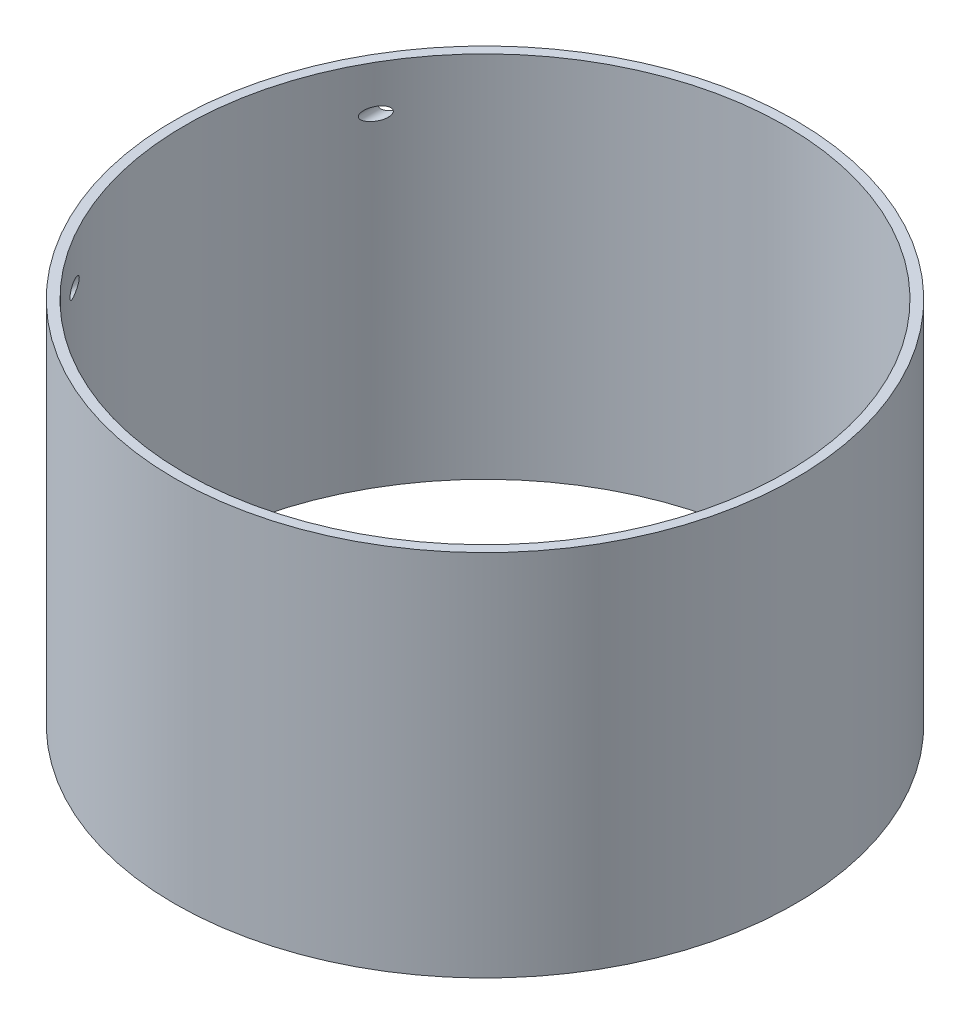
ISO-10303-21;
HEADER;
FILE_DESCRIPTION(('STEP AP214'),'2;1');
FILE_NAME('part.step','',(''),(''),'','','');
FILE_SCHEMA(('AUTOMOTIVE_DESIGN { 1 0 10303 214 1 1 1 1 }'));
ENDSEC;
DATA;
#1=APPLICATION_CONTEXT('core data for automotive mechanical design processes');
#2=APPLICATION_PROTOCOL_DEFINITION('international standard','automotive_design',2000,#1);
#3=PRODUCT_CONTEXT('',#1,'mechanical');
#4=PRODUCT('Part','Part','',(#3));
#5=PRODUCT_RELATED_PRODUCT_CATEGORY('part','',(#4));
#6=PRODUCT_DEFINITION_FORMATION('','',#4);
#7=PRODUCT_DEFINITION_CONTEXT('part definition',#1,'design');
#8=PRODUCT_DEFINITION('design','',#6,#7);
#9=PRODUCT_DEFINITION_SHAPE('','',#8);
#10=(LENGTH_UNIT() NAMED_UNIT(*) SI_UNIT(.MILLI.,.METRE.));
#11=(NAMED_UNIT(*) PLANE_ANGLE_UNIT() SI_UNIT($,.RADIAN.));
#12=(NAMED_UNIT(*) SI_UNIT($,.STERADIAN.) SOLID_ANGLE_UNIT());
#13=UNCERTAINTY_MEASURE_WITH_UNIT(LENGTH_MEASURE(1.E-05),#10,'distance_accuracy_value','');
#14=(GEOMETRIC_REPRESENTATION_CONTEXT(3) GLOBAL_UNCERTAINTY_ASSIGNED_CONTEXT((#13)) GLOBAL_UNIT_ASSIGNED_CONTEXT((#10,
#11,#12)) REPRESENTATION_CONTEXT('',''));
#15=CARTESIAN_POINT('',(0.,0.,0.));
#16=DIRECTION('',(0.,0.,1.));
#17=DIRECTION('',(1.,0.,0.));
#18=AXIS2_PLACEMENT_3D('',#15,#16,#17);
#19=CARTESIAN_POINT('',(0.,25.4,0.));
#20=DIRECTION('',(0.,-1.,0.));
#21=DIRECTION('',(0.,0.,-1.));
#22=AXIS2_PLACEMENT_3D('',#19,#20,#21);
#23=CYLINDRICAL_SURFACE('',#22,101.6);
#24=CARTESIAN_POINT('',(0.,171.45,0.));
#25=DIRECTION('',(0.,1.,0.));
#26=DIRECTION('',(0.,0.,1.));
#27=AXIS2_PLACEMENT_3D('',#24,#25,#26);
#28=CIRCLE('',#27,101.6);
#29=CARTESIAN_POINT('',(0.,171.45,101.6));
#30=VERTEX_POINT('',#29);
#31=EDGE_CURVE('E10',#30,#30,#28,.T.);
#32=ORIENTED_EDGE('',*,*,#31,.F.);
#33=EDGE_LOOP('',(#32));
#34=FACE_BOUND('',#33,.T.);
#35=CARTESIAN_POINT('',(-82.975,156.8,58.631982526604));
#36=CARTESIAN_POINT('',(-82.9750069701916,156.716223390494,58.6319728571658));
#37=CARTESIAN_POINT('',(-82.9800750238246,156.632396471715,58.6248024461642));
#38=CARTESIAN_POINT('',(-82.9997275133866,156.468150598897,58.5969751791364));
#39=CARTESIAN_POINT('',(-83.0143270944433,156.387737285847,58.5762968596785));
#40=CARTESIAN_POINT('',(-83.0512783757542,156.233630110046,58.5238939186319));
#41=CARTESIAN_POINT('',(-83.0735453472675,156.159873487805,58.4922900160161));
#42=CARTESIAN_POINT('',(-83.1241518551298,156.01910483395,58.4203502101725));
#43=CARTESIAN_POINT('',(-83.1524940371646,155.952095759564,58.3800105025212));
#44=CARTESIAN_POINT('',(-83.2311981713577,155.788723660721,58.2677834706447));
#45=CARTESIAN_POINT('',(-83.2849120134787,155.697358965109,58.1910077530873));
#46=CARTESIAN_POINT('',(-83.3994556157458,155.530006955534,58.0267257835989));
#47=CARTESIAN_POINT('',(-83.4603052943858,155.454064382983,57.9391894607723));
#48=CARTESIAN_POINT('',(-83.5759508761657,155.32727470318,57.7722164273101));
#49=CARTESIAN_POINT('',(-83.6300700592509,155.274354471599,57.6938545516566));
#50=CARTESIAN_POINT('',(-83.7404793934565,155.176891066365,57.5334823780236));
#51=CARTESIAN_POINT('',(-83.7967709534556,155.13235344307,57.4514697068713));
#52=CARTESIAN_POINT('',(-83.910866430612,155.050796420756,57.2846987975348));
#53=CARTESIAN_POINT('',(-83.9686717711631,155.013784407132,57.1999379560392));
#54=CARTESIAN_POINT('',(-84.0852767272949,154.946632086246,57.0283877521095));
#55=CARTESIAN_POINT('',(-84.1440766582604,154.916494004315,56.9415977427599));
#56=CARTESIAN_POINT('',(-84.2986884480437,154.845933874674,56.7126105962392));
#57=CARTESIAN_POINT('',(-84.3950122094935,154.810594377097,56.5691799726809));
#58=CARTESIAN_POINT('',(-84.5882537250347,154.754714604347,56.2798157435609));
#59=CARTESIAN_POINT('',(-84.6851718104028,154.734183519156,56.1338806411474));
#60=CARTESIAN_POINT('',(-84.8791569789651,154.706851545887,55.8401270683802));
#61=CARTESIAN_POINT('',(-84.9762234486118,154.700097571483,55.6923038819924));
#62=CARTESIAN_POINT('',(-85.1695501464402,154.699904554876,55.3962001485267));
#63=CARTESIAN_POINT('',(-85.2658106036327,154.706461592166,55.247919748956));
#64=CARTESIAN_POINT('',(-85.4607608061324,154.733300457414,54.9458997733851));
#65=CARTESIAN_POINT('',(-85.5593988878925,154.754107562376,54.7921728163306));
#66=CARTESIAN_POINT('',(-85.7546953545226,154.810438980546,54.486009424797));
#67=CARTESIAN_POINT('',(-85.8513524297379,154.845972719913,54.3335738808055));
#68=CARTESIAN_POINT('',(-86.0412828277664,154.932610975796,54.032296881879));
#69=CARTESIAN_POINT('',(-86.1345732871998,154.983618516699,53.8834391026149));
#70=CARTESIAN_POINT('',(-86.2714494818917,155.073307657953,53.6638096474869));
#71=CARTESIAN_POINT('',(-86.3165408167809,155.105378922504,53.5912485732326));
#72=CARTESIAN_POINT('',(-86.4055126506615,155.174298659439,53.4476800742216));
#73=CARTESIAN_POINT('',(-86.449393433357,155.211146000769,53.3766722862596));
#74=CARTESIAN_POINT('',(-86.544272154067,155.297947401047,53.2227270166106));
#75=CARTESIAN_POINT('',(-86.5949470552264,155.349050259297,53.1402300746396));
#76=CARTESIAN_POINT('',(-86.6935134515872,155.459880832134,52.9792754611917));
#77=CARTESIAN_POINT('',(-86.7414027561459,155.519615209447,52.9008209741642));
#78=CARTESIAN_POINT('',(-86.8336105118755,155.649482768974,52.7493317438014));
#79=CARTESIAN_POINT('',(-86.8778993039352,155.719690989379,52.6763423445038));
#80=CARTESIAN_POINT('',(-86.9606586191414,155.871692442834,52.5396059683285));
#81=CARTESIAN_POINT('',(-86.9991400536509,155.953463376222,52.4758416681037));
#82=CARTESIAN_POINT('',(-87.0556954014423,156.099502210155,52.3819417202016));
#83=CARTESIAN_POINT('',(-87.0762467675868,156.160185549132,52.34776485053));
#84=CARTESIAN_POINT('',(-87.1124121823352,156.286890384476,52.2875594584609));
#85=CARTESIAN_POINT('',(-87.128030129023,156.352907614271,52.261524502988));
#86=CARTESIAN_POINT('',(-87.1531945714062,156.490136111655,52.2195489855936));
#87=CARTESIAN_POINT('',(-87.1626696902436,156.561398087749,52.2037271037683));
#88=CARTESIAN_POINT('',(-87.1741525668396,156.706157258498,52.1845500445412));
#89=CARTESIAN_POINT('',(-87.1761695292592,156.779651584964,52.1811795000304));
#90=CARTESIAN_POINT('',(-87.1727566767227,156.915816387274,52.186880437848));
#91=CARTESIAN_POINT('',(-87.1683097848114,156.978589543844,52.1943096703873));
#92=CARTESIAN_POINT('',(-87.1541240662814,157.101822535777,52.2179935139109));
#93=CARTESIAN_POINT('',(-87.1443816994371,157.162280794565,52.234254028936));
#94=CARTESIAN_POINT('',(-87.116728466356,157.297429977238,52.2803646967071));
#95=CARTESIAN_POINT('',(-87.0972380268677,157.370893092849,52.3128379239913));
#96=CARTESIAN_POINT('',(-87.052418265421,157.510804862722,52.3873875452668));
#97=CARTESIAN_POINT('',(-87.0270768248515,157.577238535252,52.4294838688242));
#98=CARTESIAN_POINT('',(-86.9563999999845,157.739157703799,52.5466594320071));
#99=CARTESIAN_POINT('',(-86.9079172272073,157.829536117953,52.6268353106141));
#100=CARTESIAN_POINT('',(-86.8043310768561,157.995410424153,52.7975204595688));
#101=CARTESIAN_POINT('',(-86.749211386083,158.070868389446,52.888055163058));
#102=CARTESIAN_POINT('',(-86.6401474555037,158.202450701013,53.0665122211123));
#103=CARTESIAN_POINT('',(-86.5866072960789,158.259740166522,53.1538369525626));
#104=CARTESIAN_POINT('',(-86.4768729247724,158.36542644338,53.3321800350003));
#105=CARTESIAN_POINT('',(-86.4206766708538,158.413816268056,53.4232012200406));
#106=CARTESIAN_POINT('',(-86.3061977975174,158.502766005634,53.6079476873526));
#107=CARTESIAN_POINT('',(-86.2479116885063,158.543312023308,53.7016774363655));
#108=CARTESIAN_POINT('',(-86.1297626346507,158.617231068601,53.8909681996178));
#109=CARTESIAN_POINT('',(-86.0698992053928,158.650601863111,53.9865297739178));
#110=CARTESIAN_POINT('',(-85.9122572224367,158.728934072453,54.2372318218994));
#111=CARTESIAN_POINT('',(-85.8134805515754,158.768669076428,54.3933924826184));
#112=CARTESIAN_POINT('',(-85.6135883368883,158.83246764312,54.707478514715));
#113=CARTESIAN_POINT('',(-85.5124713362986,158.856521157393,54.8654049517874));
#114=CARTESIAN_POINT('',(-85.3085877559717,158.889522703432,55.1818838408196));
#115=CARTESIAN_POINT('',(-85.2058203262715,158.898462682406,55.340436581421));
#116=CARTESIAN_POINT('',(-84.999377496824,158.901174587753,55.6569986773372));
#117=CARTESIAN_POINT('',(-84.8957025506711,158.894953703694,55.8150082546433));
#118=CARTESIAN_POINT('',(-84.7144567638553,158.870293205551,56.0895766562435));
#119=CARTESIAN_POINT('',(-84.6369322570584,158.855351585529,56.2064872385635));
#120=CARTESIAN_POINT('',(-84.4821329719449,158.816155935917,56.4388933860953));
#121=CARTESIAN_POINT('',(-84.4048581425014,158.791903953138,56.554389256566));
#122=CARTESIAN_POINT('',(-84.2512165785137,158.733422440074,56.7830205419867));
#123=CARTESIAN_POINT('',(-84.1748480154939,158.699218812556,56.8961612779969));
#124=CARTESIAN_POINT('',(-84.0235118588865,158.619799985895,57.1194154454886));
#125=CARTESIAN_POINT('',(-83.9485434234199,158.574591649365,57.2295307162291));
#126=CARTESIAN_POINT('',(-83.7952333091637,158.467811483455,57.4537961694828));
#127=CARTESIAN_POINT('',(-83.7170740815879,158.405250358279,57.5676077997014));
#128=CARTESIAN_POINT('',(-83.5652547496683,158.263375077176,57.7877668512477));
#129=CARTESIAN_POINT('',(-83.4915926282192,158.184068504387,57.8941176222642));
#130=CARTESIAN_POINT('',(-83.3685309360524,158.026953829382,58.0711356910896));
#131=CARTESIAN_POINT('',(-83.3175187397214,157.953245401777,58.1442862571522));
#132=CARTESIAN_POINT('',(-83.2223151824853,157.793077266952,58.280469346357));
#133=CARTESIAN_POINT('',(-83.1781106486886,157.706642835443,58.3435214198818));
#134=CARTESIAN_POINT('',(-83.1115899126134,157.548349566766,58.4382231871894));
#135=CARTESIAN_POINT('',(-83.0866793640302,157.479846324202,58.4736275818791));
#136=CARTESIAN_POINT('',(-83.0434052005463,157.336821243763,58.5350686872734));
#137=CARTESIAN_POINT('',(-83.025031363016,157.262309029086,58.5611200256229));
#138=CARTESIAN_POINT('',(-82.9990790505797,157.123347233096,58.5978949116336));
#139=CARTESIAN_POINT('',(-82.9901113524311,157.059682364748,58.6105922789686));
#140=CARTESIAN_POINT('',(-82.9780695818706,156.930688358457,58.6276391874058));
#141=CARTESIAN_POINT('',(-82.9749945621079,156.865359489743,58.6319900703511));
#142=CARTESIAN_POINT('',(-82.975,156.8,58.631982526604));
#143=B_SPLINE_CURVE_WITH_KNOTS('',3,(#35,#36,#37,#38,#39,#40,#41,#42,#43,#44,#45,#46,#47,#48,
#49,#50,#51,#52,#53,#54,#55,#56,#57,#58,#59,#60,#61,#62,#63,#64,#65,#66,#67,#68,#69,#70,#71,#72,
#73,#74,#75,#76,#77,#78,#79,#80,#81,#82,#83,#84,#85,#86,#87,#88,#89,#90,#91,#92,#93,#94,#95,#96,
#97,#98,#99,#100,#101,#102,#103,#104,#105,#106,#107,#108,#109,#110,#111,#112,#113,#114,#115,
#116,#117,#118,#119,#120,#121,#122,#123,#124,#125,#126,#127,#128,#129,#130,#131,#132,#133,#134,
#135,#136,#137,#138,#139,#140,#141,#142),.UNSPECIFIED.,.T.,.F.,(4,2,2,2,2,2,2,2,2,2,2,2,2,2,2,2,
2,2,2,2,2,2,2,2,2,2,2,2,2,2,2,2,2,2,2,2,2,2,2,2,2,2,2,2,2,2,2,2,2,2,2,2,2,4),(0.,
0.250991959709652,0.50238370712089,0.751082147678964,0.99988911444596,1.39029801557907,
1.78182384890907,2.1082217415471,2.43483499680136,2.76176724909356,3.08880519099053,
3.6170717085381,4.1456657826091,4.67605683509155,5.20629169357284,5.75720504630901,
6.30847157121046,6.85635223709113,7.12998938939738,7.40356185789304,7.7316182583052,
8.0599292539234,8.39071665453365,8.72087459100963,8.93806403325407,9.1550814340244,
9.37457731028025,9.59380219989295,9.78297512488557,9.97227467497016,10.2188448011969,
10.4659302796672,10.8542891087828,11.2436227750404,11.5952124372338,11.9470769480184,
12.2995591873266,12.6521509696261,13.2183567811676,13.784925052535,14.3517951076846,
14.9183963946328,15.3413355809535,15.7641818405249,16.1859371875106,16.6074301956642,
17.0612593878206,17.5148835035185,17.860995671753,18.2064294589523,18.4487054929326,
18.6906009533281,18.8864473178587,19.0822621940284),.UNSPECIFIED.);
#144=CARTESIAN_POINT('',(-82.975,156.8,58.631982526604));
#145=VERTEX_POINT('',#144);
#146=EDGE_CURVE('E73',#145,#145,#143,.T.);
#147=ORIENTED_EDGE('',*,*,#146,.T.);
#148=EDGE_LOOP('',(#147));
#149=FACE_BOUND('',#148,.T.);
#150=CARTESIAN_POINT('',(-82.975,156.8,-58.631982526604));
#151=CARTESIAN_POINT('',(-82.9750069701916,156.883776609506,-58.6319728571658));
#152=CARTESIAN_POINT('',(-82.9800750238246,156.967603528285,-58.6248024461642));
#153=CARTESIAN_POINT('',(-82.9997275133866,157.131849401103,-58.5969751791364));
#154=CARTESIAN_POINT('',(-83.0143270944433,157.212262714153,-58.5762968596785));
#155=CARTESIAN_POINT('',(-83.0512783757542,157.366369889955,-58.5238939186319));
#156=CARTESIAN_POINT('',(-83.0735453472675,157.440126512195,-58.4922900160161));
#157=CARTESIAN_POINT('',(-83.1241518551298,157.58089516605,-58.4203502101725));
#158=CARTESIAN_POINT('',(-83.1524940371646,157.647904240436,-58.3800105025212));
#159=CARTESIAN_POINT('',(-83.2311981713577,157.81127633928,-58.2677834706447));
#160=CARTESIAN_POINT('',(-83.2849120134787,157.902641034891,-58.1910077530873));
#161=CARTESIAN_POINT('',(-83.3994556157458,158.069993044466,-58.0267257835989));
#162=CARTESIAN_POINT('',(-83.4603052943858,158.145935617017,-57.9391894607723));
#163=CARTESIAN_POINT('',(-83.5759508761657,158.27272529682,-57.7722164273101));
#164=CARTESIAN_POINT('',(-83.6300700592509,158.325645528401,-57.6938545516566));
#165=CARTESIAN_POINT('',(-83.7404793934565,158.423108933635,-57.5334823780236));
#166=CARTESIAN_POINT('',(-83.7967709534556,158.46764655693,-57.4514697068713));
#167=CARTESIAN_POINT('',(-83.910866430612,158.549203579244,-57.2846987975348));
#168=CARTESIAN_POINT('',(-83.9686717711631,158.586215592868,-57.1999379560392));
#169=CARTESIAN_POINT('',(-84.0852767272949,158.653367913755,-57.0283877521095));
#170=CARTESIAN_POINT('',(-84.1440766582604,158.683505995685,-56.9415977427599));
#171=CARTESIAN_POINT('',(-84.2986884480437,158.754066125326,-56.7126105962392));
#172=CARTESIAN_POINT('',(-84.3950122094935,158.789405622903,-56.5691799726809));
#173=CARTESIAN_POINT('',(-84.5882537250347,158.845285395653,-56.2798157435609));
#174=CARTESIAN_POINT('',(-84.6851718104028,158.865816480844,-56.1338806411474));
#175=CARTESIAN_POINT('',(-84.8791569789651,158.893148454113,-55.8401270683802));
#176=CARTESIAN_POINT('',(-84.9762234486118,158.899902428517,-55.6923038819924));
#177=CARTESIAN_POINT('',(-85.1695501464402,158.900095445124,-55.3962001485267));
#178=CARTESIAN_POINT('',(-85.2658106036327,158.893538407834,-55.247919748956));
#179=CARTESIAN_POINT('',(-85.4607608061324,158.866699542586,-54.9458997733851));
#180=CARTESIAN_POINT('',(-85.5593988878925,158.845892437624,-54.7921728163306));
#181=CARTESIAN_POINT('',(-85.7546953545226,158.789561019454,-54.486009424797));
#182=CARTESIAN_POINT('',(-85.8513524297379,158.754027280087,-54.3335738808055));
#183=CARTESIAN_POINT('',(-86.0412828277664,158.667389024204,-54.032296881879));
#184=CARTESIAN_POINT('',(-86.1345732871998,158.616381483301,-53.8834391026149));
#185=CARTESIAN_POINT('',(-86.2714494818917,158.526692342047,-53.6638096474869));
#186=CARTESIAN_POINT('',(-86.3165408167809,158.494621077496,-53.5912485732326));
#187=CARTESIAN_POINT('',(-86.4055126506615,158.425701340561,-53.4476800742216));
#188=CARTESIAN_POINT('',(-86.449393433357,158.388853999231,-53.3766722862596));
#189=CARTESIAN_POINT('',(-86.544272154067,158.302052598953,-53.2227270166106));
#190=CARTESIAN_POINT('',(-86.5949470552264,158.250949740703,-53.1402300746396));
#191=CARTESIAN_POINT('',(-86.6935134515872,158.140119167866,-52.9792754611917));
#192=CARTESIAN_POINT('',(-86.7414027561459,158.080384790553,-52.9008209741642));
#193=CARTESIAN_POINT('',(-86.8336105118755,157.950517231026,-52.7493317438014));
#194=CARTESIAN_POINT('',(-86.8778993039352,157.880309010621,-52.6763423445038));
#195=CARTESIAN_POINT('',(-86.9606586191414,157.728307557166,-52.5396059683285));
#196=CARTESIAN_POINT('',(-86.9991400536509,157.646536623778,-52.4758416681037));
#197=CARTESIAN_POINT('',(-87.0556954014423,157.500497789845,-52.3819417202016));
#198=CARTESIAN_POINT('',(-87.0762467675868,157.439814450868,-52.34776485053));
#199=CARTESIAN_POINT('',(-87.1124121823352,157.313109615524,-52.2875594584609));
#200=CARTESIAN_POINT('',(-87.128030129023,157.247092385729,-52.261524502988));
#201=CARTESIAN_POINT('',(-87.1531945714062,157.109863888345,-52.2195489855936));
#202=CARTESIAN_POINT('',(-87.1626696902436,157.038601912251,-52.2037271037683));
#203=CARTESIAN_POINT('',(-87.1741525668396,156.893842741502,-52.1845500445412));
#204=CARTESIAN_POINT('',(-87.1761695292592,156.820348415036,-52.1811795000304));
#205=CARTESIAN_POINT('',(-87.1727566767227,156.684183612727,-52.186880437848));
#206=CARTESIAN_POINT('',(-87.1683097848114,156.621410456156,-52.1943096703873));
#207=CARTESIAN_POINT('',(-87.1541240662814,156.498177464223,-52.2179935139109));
#208=CARTESIAN_POINT('',(-87.1443816994371,156.437719205435,-52.234254028936));
#209=CARTESIAN_POINT('',(-87.116728466356,156.302570022762,-52.2803646967071));
#210=CARTESIAN_POINT('',(-87.0972380268677,156.229106907151,-52.3128379239913));
#211=CARTESIAN_POINT('',(-87.052418265421,156.089195137278,-52.3873875452668));
#212=CARTESIAN_POINT('',(-87.0270768248515,156.022761464748,-52.4294838688242));
#213=CARTESIAN_POINT('',(-86.9563999999845,155.860842296201,-52.5466594320071));
#214=CARTESIAN_POINT('',(-86.9079172272073,155.770463882047,-52.6268353106141));
#215=CARTESIAN_POINT('',(-86.8043310768561,155.604589575847,-52.7975204595688));
#216=CARTESIAN_POINT('',(-86.749211386083,155.529131610554,-52.888055163058));
#217=CARTESIAN_POINT('',(-86.6401474555037,155.397549298987,-53.0665122211123));
#218=CARTESIAN_POINT('',(-86.5866072960789,155.340259833478,-53.1538369525626));
#219=CARTESIAN_POINT('',(-86.4768729247724,155.23457355662,-53.3321800350003));
#220=CARTESIAN_POINT('',(-86.4206766708538,155.186183731944,-53.4232012200406));
#221=CARTESIAN_POINT('',(-86.3061977975174,155.097233994366,-53.6079476873526));
#222=CARTESIAN_POINT('',(-86.2479116885063,155.056687976692,-53.7016774363655));
#223=CARTESIAN_POINT('',(-86.1297626346507,154.982768931399,-53.8909681996178));
#224=CARTESIAN_POINT('',(-86.0698992053928,154.949398136889,-53.9865297739178));
#225=CARTESIAN_POINT('',(-85.9122572224367,154.871065927547,-54.2372318218994));
#226=CARTESIAN_POINT('',(-85.8134805515754,154.831330923572,-54.3933924826184));
#227=CARTESIAN_POINT('',(-85.6135883368883,154.76753235688,-54.707478514715));
#228=CARTESIAN_POINT('',(-85.5124713362986,154.743478842607,-54.8654049517874));
#229=CARTESIAN_POINT('',(-85.3085877559717,154.710477296569,-55.1818838408196));
#230=CARTESIAN_POINT('',(-85.2058203262715,154.701537317594,-55.340436581421));
#231=CARTESIAN_POINT('',(-84.999377496824,154.698825412247,-55.6569986773372));
#232=CARTESIAN_POINT('',(-84.8957025506711,154.705046296306,-55.8150082546433));
#233=CARTESIAN_POINT('',(-84.7144567638553,154.729706794449,-56.0895766562435));
#234=CARTESIAN_POINT('',(-84.6369322570584,154.744648414471,-56.2064872385635));
#235=CARTESIAN_POINT('',(-84.4821329719449,154.783844064083,-56.4388933860953));
#236=CARTESIAN_POINT('',(-84.4048581425014,154.808096046862,-56.554389256566));
#237=CARTESIAN_POINT('',(-84.2512165785137,154.866577559926,-56.7830205419867));
#238=CARTESIAN_POINT('',(-84.1748480154939,154.900781187444,-56.8961612779969));
#239=CARTESIAN_POINT('',(-84.0235118588865,154.980200014105,-57.1194154454886));
#240=CARTESIAN_POINT('',(-83.9485434234199,155.025408350635,-57.2295307162291));
#241=CARTESIAN_POINT('',(-83.7952333091637,155.132188516545,-57.4537961694828));
#242=CARTESIAN_POINT('',(-83.7170740815879,155.194749641721,-57.5676077997014));
#243=CARTESIAN_POINT('',(-83.5652547496683,155.336624922824,-57.7877668512477));
#244=CARTESIAN_POINT('',(-83.4915926282192,155.415931495613,-57.8941176222642));
#245=CARTESIAN_POINT('',(-83.3685309360524,155.573046170618,-58.0711356910896));
#246=CARTESIAN_POINT('',(-83.3175187397214,155.646754598223,-58.1442862571522));
#247=CARTESIAN_POINT('',(-83.2223151824853,155.806922733048,-58.280469346357));
#248=CARTESIAN_POINT('',(-83.1781106486886,155.893357164557,-58.3435214198818));
#249=CARTESIAN_POINT('',(-83.1115899126134,156.051650433234,-58.4382231871893));
#250=CARTESIAN_POINT('',(-83.0866793640302,156.120153675797,-58.4736275818791));
#251=CARTESIAN_POINT('',(-83.0434052005463,156.263178756237,-58.5350686872734));
#252=CARTESIAN_POINT('',(-83.025031363016,156.337690970914,-58.5611200256229));
#253=CARTESIAN_POINT('',(-82.9990790505797,156.476652766904,-58.5978949116336));
#254=CARTESIAN_POINT('',(-82.9901113524311,156.540317635252,-58.6105922789686));
#255=CARTESIAN_POINT('',(-82.9780695818706,156.669311641543,-58.6276391874058));
#256=CARTESIAN_POINT('',(-82.9749945621079,156.734640510257,-58.6319900703511));
#257=CARTESIAN_POINT('',(-82.975,156.8,-58.631982526604));
#258=B_SPLINE_CURVE_WITH_KNOTS('',3,(#150,#151,#152,#153,#154,#155,#156,#157,#158,#159,#160,
#161,#162,#163,#164,#165,#166,#167,#168,#169,#170,#171,#172,#173,#174,#175,#176,#177,#178,#179,
#180,#181,#182,#183,#184,#185,#186,#187,#188,#189,#190,#191,#192,#193,#194,#195,#196,#197,#198,
#199,#200,#201,#202,#203,#204,#205,#206,#207,#208,#209,#210,#211,#212,#213,#214,#215,#216,#217,
#218,#219,#220,#221,#222,#223,#224,#225,#226,#227,#228,#229,#230,#231,#232,#233,#234,#235,#236,
#237,#238,#239,#240,#241,#242,#243,#244,#245,#246,#247,#248,#249,#250,#251,#252,#253,#254,#255,
#256,#257),.UNSPECIFIED.,.T.,.F.,(4,2,2,2,2,2,2,2,2,2,2,2,2,2,2,2,2,2,2,2,2,2,2,2,2,2,2,2,2,2,2,
2,2,2,2,2,2,2,2,2,2,2,2,2,2,2,2,2,2,2,2,2,2,4),(0.,0.250991959709652,0.50238370712089,
0.751082147678964,0.99988911444596,1.39029801557907,1.78182384890907,2.1082217415471,
2.43483499680136,2.76176724909356,3.08880519099053,3.6170717085381,4.1456657826091,
4.67605683509155,5.20629169357284,5.757205046309,6.30847157121046,6.85635223709113,
7.12998938939738,7.40356185789304,7.7316182583052,8.0599292539234,8.39071665453365,
8.72087459100963,8.9380640332541,9.1550814340244,9.37457731028025,9.59380219989295,
9.78297512488557,9.97227467497016,10.2188448011969,10.4659302796672,10.8542891087828,
11.2436227750404,11.5952124372338,11.9470769480184,12.2995591873266,12.6521509696261,
13.2183567811676,13.784925052535,14.3517951076846,14.9183963946328,15.3413355809535,
15.7641818405249,16.1859371875106,16.6074301956642,17.0612593878205,17.5148835035185,
17.860995671753,18.2064294589523,18.4487054929325,18.6906009533281,18.8864473178587,
19.0822621940284),.UNSPECIFIED.);
#259=CARTESIAN_POINT('',(-82.975,156.8,-58.631982526604));
#260=VERTEX_POINT('',#259);
#261=EDGE_CURVE('E45',#260,#260,#258,.T.);
#262=ORIENTED_EDGE('',*,*,#261,.T.);
#263=EDGE_LOOP('',(#262));
#264=FACE_BOUND('',#263,.T.);
#265=CARTESIAN_POINT('',(0.,50.8,0.));
#266=DIRECTION('',(0.,-1.,0.));
#267=DIRECTION('',(0.,0.,-1.));
#268=AXIS2_PLACEMENT_3D('',#265,#266,#267);
#269=CIRCLE('',#268,101.6);
#270=CARTESIAN_POINT('',(0.,50.8,-101.6));
#271=VERTEX_POINT('',#270);
#272=EDGE_CURVE('E79',#271,#271,#269,.T.);
#273=ORIENTED_EDGE('',*,*,#272,.F.);
#274=EDGE_LOOP('',(#273));
#275=FACE_BOUND('',#274,.T.);
#276=ADVANCED_FACE('F32',(#34,#149,#264,#275),#23,.T.);
#277=CARTESIAN_POINT('',(0.,171.45,0.));
#278=DIRECTION('',(0.,-1.,0.));
#279=DIRECTION('',(0.,0.,-1.));
#280=AXIS2_PLACEMENT_3D('',#277,#278,#279);
#281=CYLINDRICAL_SURFACE('',#280,98.425);
#282=CARTESIAN_POINT('',(0.,171.45,0.));
#283=DIRECTION('',(0.,1.,0.));
#284=DIRECTION('',(0.,0.,1.));
#285=AXIS2_PLACEMENT_3D('',#282,#283,#284);
#286=CIRCLE('',#285,98.425);
#287=CARTESIAN_POINT('',(0.,171.45,98.425));
#288=VERTEX_POINT('',#287);
#289=EDGE_CURVE('E40',#288,#288,#286,.T.);
#290=ORIENTED_EDGE('',*,*,#289,.T.);
#291=EDGE_LOOP('',(#290));
#292=FACE_BOUND('',#291,.T.);
#293=CARTESIAN_POINT('',(-82.975,156.8,52.9398715525454));
#294=CARTESIAN_POINT('',(-82.9749977967055,156.732653349902,52.9398749456127));
#295=CARTESIAN_POINT('',(-82.9782664156455,156.665319817923,52.9347529751313));
#296=CARTESIAN_POINT('',(-82.9910124409422,156.532721568156,52.9147674579609));
#297=CARTESIAN_POINT('',(-83.0004930911946,156.467457949946,52.8998988216038));
#298=CARTESIAN_POINT('',(-83.0247655851605,156.341018782509,52.8617954802858));
#299=CARTESIAN_POINT('',(-83.0395215486433,156.279818849971,52.8386172901314));
#300=CARTESIAN_POINT('',(-83.0733741662101,156.161824989435,52.7853779819136));
#301=CARTESIAN_POINT('',(-83.0924723679343,156.105032642071,52.7553144097667));
#302=CARTESIAN_POINT('',(-83.148518026697,155.958319985268,52.6669616920792));
#303=CARTESIAN_POINT('',(-83.1886636860767,155.872713501086,52.6035493503535));
#304=CARTESIAN_POINT('',(-83.2753311003864,155.713989249372,52.4662414554161));
#305=CARTESIAN_POINT('',(-83.321873244711,155.640913168813,52.3923123514899));
#306=CARTESIAN_POINT('',(-83.411874765365,155.515855739155,52.2488838802413));
#307=CARTESIAN_POINT('',(-83.454777461571,155.462352727643,52.1803375976439));
#308=CARTESIAN_POINT('',(-83.5426956297842,155.362476268942,52.0394612944644));
#309=CARTESIAN_POINT('',(-83.5877126069722,155.316108004643,51.9671285739446));
#310=CARTESIAN_POINT('',(-83.6792631330498,155.229686514632,51.8195821688306));
#311=CARTESIAN_POINT('',(-83.7257984860384,155.189641157771,51.7443650369658));
#312=CARTESIAN_POINT('',(-83.8199109379569,155.115260877993,51.5917745929848));
#313=CARTESIAN_POINT('',(-83.8674884035615,155.080928002802,51.5144005192345));
#314=CARTESIAN_POINT('',(-84.0019076183959,154.991891163047,51.2951017987921));
#315=CARTESIAN_POINT('',(-84.0895606642024,154.943004363025,51.1512981124826));
#316=CARTESIAN_POINT('',(-84.2659562438472,154.859650456187,50.860183725283));
#317=CARTESIAN_POINT('',(-84.3546995827209,154.825194756867,50.7128703468959));
#318=CARTESIAN_POINT('',(-84.5326498780502,154.769095113838,50.4156898734273));
#319=CARTESIAN_POINT('',(-84.6218574194849,154.747478629638,50.2658180051727));
#320=CARTESIAN_POINT('',(-84.7999716268211,154.716125951082,49.9647479046305));
#321=CARTESIAN_POINT('',(-84.8888783721851,154.70638632702,49.813550067954));
#322=CARTESIAN_POINT('',(-85.072982070005,154.697823825788,49.498527168161));
#323=CARTESIAN_POINT('',(-85.1681234391167,154.699920359108,49.3346447594915));
#324=CARTESIAN_POINT('',(-85.3571991821862,154.716883144082,49.0067851920012));
#325=CARTESIAN_POINT('',(-85.4511332033512,154.73175304578,48.8428080194869));
#326=CARTESIAN_POINT('',(-85.6370425241465,154.774370260417,48.5161085038239));
#327=CARTESIAN_POINT('',(-85.729023113232,154.802076371571,48.3533838268763));
#328=CARTESIAN_POINT('',(-85.9108011919607,154.871038916852,48.0296707653553));
#329=CARTESIAN_POINT('',(-86.0005999064114,154.912287550799,47.8686814362622));
#330=CARTESIAN_POINT('',(-86.1637918021441,155.00227239067,47.5742098876876));
#331=CARTESIAN_POINT('',(-86.2375856744718,155.048884280258,47.4403019322253));
#332=CARTESIAN_POINT('',(-86.3826611418466,155.154370108862,47.1756210879793));
#333=CARTESIAN_POINT('',(-86.4539394164672,155.213259594129,47.0448524106291));
#334=CARTESIAN_POINT('',(-86.558331249683,155.312704516148,46.8523353369493));
#335=CARTESIAN_POINT('',(-86.5928332898123,155.347858961965,46.7885345539324));
#336=CARTESIAN_POINT('',(-86.6606822488613,155.42226625287,46.6627460873636));
#337=CARTESIAN_POINT('',(-86.6940295427927,155.461517750469,46.6007578162235));
#338=CARTESIAN_POINT('',(-86.7592155976507,155.544533222305,46.4792843532738));
#339=CARTESIAN_POINT('',(-86.7910577309514,155.588286335549,46.4197936027726));
#340=CARTESIAN_POINT('',(-86.8528868638212,155.680973187265,46.3040059612082));
#341=CARTESIAN_POINT('',(-86.8828752324063,155.729903028495,46.2477067158119));
#342=CARTESIAN_POINT('',(-86.9392804692286,155.831647084146,46.1415821291093));
#343=CARTESIAN_POINT('',(-86.9657916939644,155.884231060789,46.0915887888745));
#344=CARTESIAN_POINT('',(-87.0157992717826,155.995620492549,45.997110328023));
#345=CARTESIAN_POINT('',(-87.0392930694434,156.05443114507,45.9526298773056));
#346=CARTESIAN_POINT('',(-87.0823497833248,156.179533068951,45.8709835918357));
#347=CARTESIAN_POINT('',(-87.1018595853696,156.245909067187,45.8339167128905));
#348=CARTESIAN_POINT('',(-87.1348585341947,156.385207402255,45.7711516994349));
#349=CARTESIAN_POINT('',(-87.1483661400389,156.458108828175,45.7454187110292));
#350=CARTESIAN_POINT('',(-87.1649219321133,156.587382514394,45.713862583692));
#351=CARTESIAN_POINT('',(-87.1698425454478,156.642643916415,45.7044768614137));
#352=CARTESIAN_POINT('',(-87.1752395428845,156.754165819185,45.6941820550873));
#353=CARTESIAN_POINT('',(-87.1757186098904,156.810425696226,45.6932678538409));
#354=CARTESIAN_POINT('',(-87.1721859141059,156.922230267337,45.7000069977341));
#355=CARTESIAN_POINT('',(-87.1681773483323,156.977775442067,45.7076542436472));
#356=CARTESIAN_POINT('',(-87.1560556764321,157.086744386363,45.7307637236623));
#357=CARTESIAN_POINT('',(-87.1479390575095,157.14016629809,45.7462326460682));
#358=CARTESIAN_POINT('',(-87.1245831965236,157.263070576689,45.790702751682));
#359=CARTESIAN_POINT('',(-87.1078211289476,157.331210529932,45.8225905978053));
#360=CARTESIAN_POINT('',(-87.0694407655194,157.460914354391,45.8954770823911));
#361=CARTESIAN_POINT('',(-87.0478109993712,157.522462177841,45.936497237831));
#362=CARTESIAN_POINT('',(-86.986082870588,157.676604912136,46.0533242028367));
#363=CARTESIAN_POINT('',(-86.9430296027654,157.763831793668,46.1345821496978));
#364=CARTESIAN_POINT('',(-86.8512419684533,157.924058230084,46.3071490626639));
#365=CARTESIAN_POINT('',(-86.8024929800845,157.997019821953,46.3984838627609));
#366=CARTESIAN_POINT('',(-86.7026643522472,158.12942546327,46.5847559555512));
#367=CARTESIAN_POINT('',(-86.6516849967602,158.189184784167,46.6795262699613));
#368=CARTESIAN_POINT('',(-86.5471791604898,158.299487462667,46.873004185821));
#369=CARTESIAN_POINT('',(-86.4936503895466,158.350022329189,46.9717153139515));
#370=CARTESIAN_POINT('',(-86.384594973927,158.443201314657,47.171976881029));
#371=CARTESIAN_POINT('',(-86.3290646862267,158.485830077071,47.2735324136514));
#372=CARTESIAN_POINT('',(-86.2164909668968,158.563997905871,47.478532072408));
#373=CARTESIAN_POINT('',(-86.1594470385633,158.599534611559,47.5819768149299));
#374=CARTESIAN_POINT('',(-85.9993775387722,158.689270851096,47.8709963416262));
#375=CARTESIAN_POINT('',(-85.8950243902701,158.736550221034,48.058005290253));
#376=CARTESIAN_POINT('',(-85.683468549836,158.813058353127,48.4341874537159));
#377=CARTESIAN_POINT('',(-85.576263654841,158.84227271065,48.6233622734743));
#378=CARTESIAN_POINT('',(-85.3597324795081,158.883525403345,49.0024935515448));
#379=CARTESIAN_POINT('',(-85.250405115154,158.895554714445,49.1924503680288));
#380=CARTESIAN_POINT('',(-85.0303934085639,158.902408094627,49.5717747044316));
#381=CARTESIAN_POINT('',(-84.9197098787577,158.897242006602,49.7611424993948));
#382=CARTESIAN_POINT('',(-84.7309253473263,158.873101631744,50.0816776194922));
#383=CARTESIAN_POINT('',(-84.6529886853473,158.858723524496,50.2132987107951));
#384=CARTESIAN_POINT('',(-84.4971174906948,158.820518113294,50.4751518713922));
#385=CARTESIAN_POINT('',(-84.4191829612983,158.79669288093,50.6053842387842));
#386=CARTESIAN_POINT('',(-84.2639422521036,158.738822129569,50.8634571285458));
#387=CARTESIAN_POINT('',(-84.1866349291427,158.704805136176,50.9913032823248));
#388=CARTESIAN_POINT('',(-84.0330703491689,158.625337259187,51.2439805296204));
#389=CARTESIAN_POINT('',(-83.9568124756448,158.579893419823,51.3688134289253));
#390=CARTESIAN_POINT('',(-83.8043141499008,158.474565998864,51.6172385678881));
#391=CARTESIAN_POINT('',(-83.7281220412024,158.414349043252,51.7407212884477));
#392=CARTESIAN_POINT('',(-83.5792699237912,158.277507932734,51.9808246596773));
#393=CARTESIAN_POINT('',(-83.5066099793017,158.200883479636,52.097445185584));
#394=CARTESIAN_POINT('',(-83.3834806044079,158.04744225855,52.2942260364981));
#395=CARTESIAN_POINT('',(-83.3317172666478,157.974615080903,52.3766546406773));
#396=CARTESIAN_POINT('',(-83.2343311312309,157.815200210903,52.5312765249738));
#397=CARTESIAN_POINT('',(-83.1886938488382,157.728646072474,52.6034939712258));
#398=CARTESIAN_POINT('',(-83.1214932450851,157.573453866961,52.709586124717));
#399=CARTESIAN_POINT('',(-83.0971017745731,157.509186791276,52.7480230316074));
#400=CARTESIAN_POINT('',(-83.0538413666202,157.374380218083,52.816111944735));
#401=CARTESIAN_POINT('',(-83.0349670317942,157.30384693947,52.8457725371453));
#402=CARTESIAN_POINT('',(-83.005280972292,157.162156545498,52.8923877655383));
#403=CARTESIAN_POINT('',(-82.9940341773962,157.091322101534,52.9100283694106));
#404=CARTESIAN_POINT('',(-82.9788989868844,156.946984524108,52.9337619876636));
#405=CARTESIAN_POINT('',(-82.9750024040972,156.873484452962,52.9398678502425));
#406=CARTESIAN_POINT('',(-82.975,156.8,52.9398715525454));
#407=B_SPLINE_CURVE_WITH_KNOTS('',3,(#293,#294,#295,#296,#297,#298,#299,#300,#301,#302,#303,
#304,#305,#306,#307,#308,#309,#310,#311,#312,#313,#314,#315,#316,#317,#318,#319,#320,#321,#322,
#323,#324,#325,#326,#327,#328,#329,#330,#331,#332,#333,#334,#335,#336,#337,#338,#339,#340,#341,
#342,#343,#344,#345,#346,#347,#348,#349,#350,#351,#352,#353,#354,#355,#356,#357,#358,#359,#360,
#361,#362,#363,#364,#365,#366,#367,#368,#369,#370,#371,#372,#373,#374,#375,#376,#377,#378,#379,
#380,#381,#382,#383,#384,#385,#386,#387,#388,#389,#390,#391,#392,#393,#394,#395,#396,#397,#398,
#399,#400,#401,#402,#403,#404,#405,#406),.UNSPECIFIED.,.T.,.F.,(4,2,2,2,2,2,2,2,2,2,2,2,2,2,2,2,
2,2,2,2,2,2,2,2,2,2,2,2,2,2,2,2,2,2,2,2,2,2,2,2,2,2,2,2,2,2,2,2,2,2,2,2,2,2,2,2,4),(0.,
0.20175946157967,0.403624365126689,0.604141612624222,0.804730439882049,1.14431427652498,
1.48500682131095,1.77548544460571,2.06617409389985,2.35722170104309,2.64837341486759,
3.1736294970435,3.69930000358272,4.22609076219149,4.75272936232607,5.32081181027481,
5.88905664422154,6.45549002451864,7.02159772300165,7.50072185479063,7.9804563929059,
8.22215976106686,8.46378388387782,8.70483813726064,8.94571218984621,9.17705735538995,
9.40859717021923,9.64304697252152,9.87677067500148,10.0448258178411,10.2127794408231,
10.3806134887271,10.5485912945919,10.7785150802316,11.0089864416516,11.3870954148982,
11.7661973164536,12.1349250668366,12.5039905369313,12.8737655259721,13.2436633957263,
13.9006341162043,14.5581280170677,15.2159670490279,15.8734295892334,16.3340900564625,
16.79464956475,17.253931872849,17.7129317414448,18.1834361459594,18.6539491021908,
19.0176885313302,19.3805521708062,19.6160847591972,19.8513861501465,20.0717790913775,
20.2919263985207),.UNSPECIFIED.);
#408=CARTESIAN_POINT('',(-82.975,156.8,52.9398715525454));
#409=VERTEX_POINT('',#408);
#410=EDGE_CURVE('E49',#409,#409,#407,.T.);
#411=ORIENTED_EDGE('',*,*,#410,.F.);
#412=EDGE_LOOP('',(#411));
#413=FACE_BOUND('',#412,.T.);
#414=CARTESIAN_POINT('',(-82.975,156.8,-52.9398715525454));
#415=CARTESIAN_POINT('',(-82.9749977967054,156.867346650098,-52.9398749456127));
#416=CARTESIAN_POINT('',(-82.9782664156455,156.934680182077,-52.9347529751312));
#417=CARTESIAN_POINT('',(-82.9910124409422,157.067278431844,-52.9147674579608));
#418=CARTESIAN_POINT('',(-83.0004930911946,157.132542050054,-52.8998988216038));
#419=CARTESIAN_POINT('',(-83.0247655851605,157.258981217492,-52.8617954802858));
#420=CARTESIAN_POINT('',(-83.0395215486433,157.320181150029,-52.8386172901314));
#421=CARTESIAN_POINT('',(-83.0733741662101,157.438175010565,-52.7853779819136));
#422=CARTESIAN_POINT('',(-83.0924723679343,157.494967357929,-52.7553144097667));
#423=CARTESIAN_POINT('',(-83.1485180266969,157.641680014732,-52.6669616920792));
#424=CARTESIAN_POINT('',(-83.1886636860767,157.727286498914,-52.6035493503535));
#425=CARTESIAN_POINT('',(-83.2753311003864,157.886010750628,-52.4662414554162));
#426=CARTESIAN_POINT('',(-83.321873244711,157.959086831187,-52.3923123514899));
#427=CARTESIAN_POINT('',(-83.411874765365,158.084144260845,-52.2488838802413));
#428=CARTESIAN_POINT('',(-83.454777461571,158.137647272357,-52.1803375976438));
#429=CARTESIAN_POINT('',(-83.5426956297842,158.237523731058,-52.0394612944644));
#430=CARTESIAN_POINT('',(-83.5877126069722,158.283891995357,-51.9671285739446));
#431=CARTESIAN_POINT('',(-83.6792631330498,158.370313485368,-51.8195821688306));
#432=CARTESIAN_POINT('',(-83.7257984860384,158.410358842229,-51.7443650369658));
#433=CARTESIAN_POINT('',(-83.8199109379569,158.484739122007,-51.5917745929848));
#434=CARTESIAN_POINT('',(-83.8674884035615,158.519071997198,-51.5144005192345));
#435=CARTESIAN_POINT('',(-84.0019076183959,158.608108836953,-51.2951017987921));
#436=CARTESIAN_POINT('',(-84.0895606642024,158.656995636975,-51.1512981124826));
#437=CARTESIAN_POINT('',(-84.2659562438473,158.740349543813,-50.860183725283));
#438=CARTESIAN_POINT('',(-84.354699582721,158.774805243133,-50.7128703468959));
#439=CARTESIAN_POINT('',(-84.5326498780502,158.830904886162,-50.4156898734273));
#440=CARTESIAN_POINT('',(-84.6218574194849,158.852521370362,-50.2658180051727));
#441=CARTESIAN_POINT('',(-84.7999716268211,158.883874048919,-49.9647479046305));
#442=CARTESIAN_POINT('',(-84.8888783721851,158.89361367298,-49.813550067954));
#443=CARTESIAN_POINT('',(-85.072982070005,158.902176174212,-49.498527168161));
#444=CARTESIAN_POINT('',(-85.1681234391167,158.900079640892,-49.3346447594915));
#445=CARTESIAN_POINT('',(-85.3571991821862,158.883116855918,-49.0067851920012));
#446=CARTESIAN_POINT('',(-85.4511332033512,158.86824695422,-48.8428080194869));
#447=CARTESIAN_POINT('',(-85.6370425241465,158.825629739583,-48.5161085038239));
#448=CARTESIAN_POINT('',(-85.729023113232,158.797923628429,-48.3533838268763));
#449=CARTESIAN_POINT('',(-85.9108011919607,158.728961083148,-48.0296707653553));
#450=CARTESIAN_POINT('',(-86.0005999064114,158.687712449201,-47.8686814362622));
#451=CARTESIAN_POINT('',(-86.1637918021441,158.59772760933,-47.5742098876876));
#452=CARTESIAN_POINT('',(-86.2375856744718,158.551115719742,-47.4403019322253));
#453=CARTESIAN_POINT('',(-86.3826611418466,158.445629891138,-47.1756210879793));
#454=CARTESIAN_POINT('',(-86.4539394164672,158.386740405871,-47.0448524106291));
#455=CARTESIAN_POINT('',(-86.558331249683,158.287295483852,-46.8523353369493));
#456=CARTESIAN_POINT('',(-86.5928332898123,158.252141038035,-46.7885345539324));
#457=CARTESIAN_POINT('',(-86.6606822488613,158.17773374713,-46.6627460873636));
#458=CARTESIAN_POINT('',(-86.6940295427927,158.138482249531,-46.6007578162235));
#459=CARTESIAN_POINT('',(-86.7592155976507,158.055466777695,-46.4792843532738));
#460=CARTESIAN_POINT('',(-86.7910577309514,158.011713664451,-46.4197936027726));
#461=CARTESIAN_POINT('',(-86.8528868638212,157.919026812735,-46.3040059612082));
#462=CARTESIAN_POINT('',(-86.8828752324063,157.870096971505,-46.2477067158119));
#463=CARTESIAN_POINT('',(-86.9392804692286,157.768352915854,-46.1415821291093));
#464=CARTESIAN_POINT('',(-86.9657916939644,157.715768939211,-46.0915887888745));
#465=CARTESIAN_POINT('',(-87.0157992717826,157.604379507451,-45.997110328023));
#466=CARTESIAN_POINT('',(-87.0392930694434,157.54556885493,-45.9526298773056));
#467=CARTESIAN_POINT('',(-87.0823497833248,157.420466931049,-45.8709835918357));
#468=CARTESIAN_POINT('',(-87.1018595853696,157.354090932813,-45.8339167128905));
#469=CARTESIAN_POINT('',(-87.1348585341947,157.214792597746,-45.7711516994349));
#470=CARTESIAN_POINT('',(-87.1483661400389,157.141891171825,-45.7454187110292));
#471=CARTESIAN_POINT('',(-87.1649219321133,157.012617485606,-45.713862583692));
#472=CARTESIAN_POINT('',(-87.1698425454478,156.957356083585,-45.7044768614137));
#473=CARTESIAN_POINT('',(-87.1752395428845,156.845834180815,-45.6941820550873));
#474=CARTESIAN_POINT('',(-87.1757186098904,156.789574303775,-45.6932678538409));
#475=CARTESIAN_POINT('',(-87.1721859141059,156.677769732663,-45.7000069977341));
#476=CARTESIAN_POINT('',(-87.1681773483323,156.622224557933,-45.7076542436472));
#477=CARTESIAN_POINT('',(-87.1560556764321,156.513255613637,-45.7307637236623));
#478=CARTESIAN_POINT('',(-87.1479390575095,156.45983370191,-45.7462326460682));
#479=CARTESIAN_POINT('',(-87.1245831965236,156.336929423311,-45.790702751682));
#480=CARTESIAN_POINT('',(-87.1078211289476,156.268789470068,-45.8225905978053));
#481=CARTESIAN_POINT('',(-87.0694407655194,156.139085645609,-45.8954770823911));
#482=CARTESIAN_POINT('',(-87.0478109993712,156.077537822159,-45.936497237831));
#483=CARTESIAN_POINT('',(-86.986082870588,155.923395087864,-46.0533242028367));
#484=CARTESIAN_POINT('',(-86.9430296027654,155.836168206332,-46.1345821496978));
#485=CARTESIAN_POINT('',(-86.8512419684533,155.675941769916,-46.3071490626639));
#486=CARTESIAN_POINT('',(-86.8024929800845,155.602980178047,-46.3984838627609));
#487=CARTESIAN_POINT('',(-86.7026643522472,155.47057453673,-46.5847559555512));
#488=CARTESIAN_POINT('',(-86.6516849967602,155.410815215833,-46.6795262699613));
#489=CARTESIAN_POINT('',(-86.5471791604898,155.300512537333,-46.873004185821));
#490=CARTESIAN_POINT('',(-86.4936503895466,155.249977670811,-46.9717153139515));
#491=CARTESIAN_POINT('',(-86.384594973927,155.156798685343,-47.171976881029));
#492=CARTESIAN_POINT('',(-86.3290646862267,155.114169922929,-47.2735324136514));
#493=CARTESIAN_POINT('',(-86.2164909668968,155.036002094129,-47.478532072408));
#494=CARTESIAN_POINT('',(-86.1594470385633,155.000465388441,-47.5819768149299));
#495=CARTESIAN_POINT('',(-85.9993775387722,154.910729148904,-47.8709963416262));
#496=CARTESIAN_POINT('',(-85.8950243902701,154.863449778966,-48.058005290253));
#497=CARTESIAN_POINT('',(-85.683468549836,154.786941646873,-48.4341874537159));
#498=CARTESIAN_POINT('',(-85.576263654841,154.75772728935,-48.6233622734743));
#499=CARTESIAN_POINT('',(-85.3597324795081,154.716474596655,-49.0024935515448));
#500=CARTESIAN_POINT('',(-85.250405115154,154.704445285555,-49.1924503680288));
#501=CARTESIAN_POINT('',(-85.0303934085639,154.697591905373,-49.5717747044316));
#502=CARTESIAN_POINT('',(-84.9197098787577,154.702757993398,-49.7611424993948));
#503=CARTESIAN_POINT('',(-84.7309253473263,154.726898368256,-50.0816776194922));
#504=CARTESIAN_POINT('',(-84.6529886853473,154.741276475504,-50.2132987107951));
#505=CARTESIAN_POINT('',(-84.4971174906948,154.779481886706,-50.4751518713922));
#506=CARTESIAN_POINT('',(-84.4191829612983,154.80330711907,-50.6053842387842));
#507=CARTESIAN_POINT('',(-84.2639422521036,154.861177870432,-50.8634571285458));
#508=CARTESIAN_POINT('',(-84.1866349291427,154.895194863825,-50.9913032823248));
#509=CARTESIAN_POINT('',(-84.0330703491689,154.974662740813,-51.2439805296204));
#510=CARTESIAN_POINT('',(-83.9568124756448,155.020106580177,-51.3688134289253));
#511=CARTESIAN_POINT('',(-83.8043141499008,155.125434001136,-51.6172385678881));
#512=CARTESIAN_POINT('',(-83.7281220412024,155.185650956748,-51.7407212884477));
#513=CARTESIAN_POINT('',(-83.5792699237912,155.322492067266,-51.9808246596773));
#514=CARTESIAN_POINT('',(-83.5066099793017,155.399116520364,-52.097445185584));
#515=CARTESIAN_POINT('',(-83.3834806044079,155.55255774145,-52.2942260364981));
#516=CARTESIAN_POINT('',(-83.3317172666478,155.625384919097,-52.3766546406773));
#517=CARTESIAN_POINT('',(-83.2343311312309,155.784799789097,-52.5312765249738));
#518=CARTESIAN_POINT('',(-83.1886938488382,155.871353927526,-52.6034939712258));
#519=CARTESIAN_POINT('',(-83.1214932450851,156.026546133039,-52.709586124717));
#520=CARTESIAN_POINT('',(-83.0971017745731,156.090813208724,-52.7480230316074));
#521=CARTESIAN_POINT('',(-83.0538413666202,156.225619781917,-52.816111944735));
#522=CARTESIAN_POINT('',(-83.0349670317942,156.29615306053,-52.8457725371453));
#523=CARTESIAN_POINT('',(-83.005280972292,156.437843454502,-52.8923877655383));
#524=CARTESIAN_POINT('',(-82.9940341773962,156.508677898466,-52.9100283694106));
#525=CARTESIAN_POINT('',(-82.9788989868844,156.653015475892,-52.9337619876636));
#526=CARTESIAN_POINT('',(-82.9750024040972,156.726515547038,-52.9398678502425));
#527=CARTESIAN_POINT('',(-82.975,156.8,-52.9398715525454));
#528=B_SPLINE_CURVE_WITH_KNOTS('',3,(#414,#415,#416,#417,#418,#419,#420,#421,#422,#423,#424,
#425,#426,#427,#428,#429,#430,#431,#432,#433,#434,#435,#436,#437,#438,#439,#440,#441,#442,#443,
#444,#445,#446,#447,#448,#449,#450,#451,#452,#453,#454,#455,#456,#457,#458,#459,#460,#461,#462,
#463,#464,#465,#466,#467,#468,#469,#470,#471,#472,#473,#474,#475,#476,#477,#478,#479,#480,#481,
#482,#483,#484,#485,#486,#487,#488,#489,#490,#491,#492,#493,#494,#495,#496,#497,#498,#499,#500,
#501,#502,#503,#504,#505,#506,#507,#508,#509,#510,#511,#512,#513,#514,#515,#516,#517,#518,#519,
#520,#521,#522,#523,#524,#525,#526,#527),.UNSPECIFIED.,.T.,.F.,(4,2,2,2,2,2,2,2,2,2,2,2,2,2,2,2,
2,2,2,2,2,2,2,2,2,2,2,2,2,2,2,2,2,2,2,2,2,2,2,2,2,2,2,2,2,2,2,2,2,2,2,2,2,2,2,2,4),(0.,
0.201759461579699,0.403624365126689,0.604141612624222,0.804730439882049,1.1443142765249,
1.48500682131094,1.77548544460573,2.06617409389985,2.35722170104308,2.64837341486759,
3.17362949704351,3.69930000358272,4.2260907621915,4.75272936232607,5.32081181027481,
5.88905664422153,6.45549002451862,7.02159772300164,7.50072185479063,7.9804563929059,
8.22215976106685,8.46378388387781,8.70483813726064,8.94571218984621,9.17705735538995,
9.40859717021923,9.64304697252152,9.87677067500147,10.044825817841,10.2127794408231,
10.3806134887271,10.5485912945919,10.7785150802316,11.0089864416516,11.3870954148982,
11.7661973164536,12.1349250668366,12.5039905369313,12.8737655259721,13.2436633957263,
13.9006341162043,14.5581280170677,15.2159670490279,15.8734295892333,16.3340900564625,
16.79464956475,17.253931872849,17.7129317414448,18.1834361459594,18.6539491021908,
19.0176885313302,19.3805521708062,19.6160847591972,19.8513861501465,20.0717790913775,
20.2919263985207),.UNSPECIFIED.);
#529=CARTESIAN_POINT('',(-82.975,156.8,-52.9398715525454));
#530=VERTEX_POINT('',#529);
#531=EDGE_CURVE('E56',#530,#530,#528,.T.);
#532=ORIENTED_EDGE('',*,*,#531,.F.);
#533=EDGE_LOOP('',(#532));
#534=FACE_BOUND('',#533,.T.);
#535=CARTESIAN_POINT('',(0.,50.8,0.));
#536=DIRECTION('',(0.,-1.,0.));
#537=DIRECTION('',(0.,0.,-1.));
#538=AXIS2_PLACEMENT_3D('',#535,#536,#537);
#539=CIRCLE('',#538,98.425);
#540=CARTESIAN_POINT('',(0.,50.8,-98.425));
#541=VERTEX_POINT('',#540);
#542=EDGE_CURVE('E36',#541,#541,#539,.T.);
#543=ORIENTED_EDGE('',*,*,#542,.T.);
#544=EDGE_LOOP('',(#543));
#545=FACE_BOUND('',#544,.T.);
#546=ADVANCED_FACE('F60',(#292,#413,#534,#545),#281,.F.);
#547=CARTESIAN_POINT('',(0.,171.45,0.));
#548=DIRECTION('',(0.,1.,0.));
#549=DIRECTION('',(0.,0.,1.));
#550=AXIS2_PLACEMENT_3D('',#547,#548,#549);
#551=PLANE('',#550);
#552=ORIENTED_EDGE('',*,*,#31,.T.);
#553=EDGE_LOOP('',(#552));
#554=FACE_BOUND('',#553,.T.);
#555=ORIENTED_EDGE('',*,*,#289,.F.);
#556=EDGE_LOOP('',(#555));
#557=FACE_BOUND('',#556,.T.);
#558=ADVANCED_FACE('F112',(#554,#557),#551,.T.);
#559=CARTESIAN_POINT('',(-85.075,156.8,-101.6));
#560=DIRECTION('',(0.,0.,1.));
#561=DIRECTION('',(1.,0.,0.));
#562=AXIS2_PLACEMENT_3D('',#559,#560,#561);
#563=CYLINDRICAL_SURFACE('',#562,2.1);
#564=ORIENTED_EDGE('',*,*,#410,.T.);
#565=EDGE_LOOP('',(#564));
#566=FACE_BOUND('',#565,.T.);
#567=ORIENTED_EDGE('',*,*,#146,.F.);
#568=EDGE_LOOP('',(#567));
#569=FACE_BOUND('',#568,.T.);
#570=ADVANCED_FACE('F67',(#566,#569),#563,.F.);
#571=ORIENTED_EDGE('',*,*,#531,.T.);
#572=EDGE_LOOP('',(#571));
#573=FACE_BOUND('',#572,.T.);
#574=ORIENTED_EDGE('',*,*,#261,.F.);
#575=EDGE_LOOP('',(#574));
#576=FACE_BOUND('',#575,.T.);
#577=ADVANCED_FACE('F62',(#573,#576),#563,.F.);
#578=CARTESIAN_POINT('',(0.,50.8,0.));
#579=DIRECTION('',(0.,-1.,0.));
#580=DIRECTION('',(0.,0.,-1.));
#581=AXIS2_PLACEMENT_3D('',#578,#579,#580);
#582=PLANE('',#581);
#583=ORIENTED_EDGE('',*,*,#542,.F.);
#584=EDGE_LOOP('',(#583));
#585=FACE_BOUND('',#584,.T.);
#586=ORIENTED_EDGE('',*,*,#272,.T.);
#587=EDGE_LOOP('',(#586));
#588=FACE_BOUND('',#587,.T.);
#589=ADVANCED_FACE('F66',(#585,#588),#582,.T.);
#590=CLOSED_SHELL('',(#276,#546,#558,#570,#577,#589));
#591=MANIFOLD_SOLID_BREP('B2',#590);
#592=ADVANCED_BREP_SHAPE_REPRESENTATION('',(#18,#591),#14);
#593=SHAPE_DEFINITION_REPRESENTATION(#9,#592);
ENDSEC;
END-ISO-10303-21;
